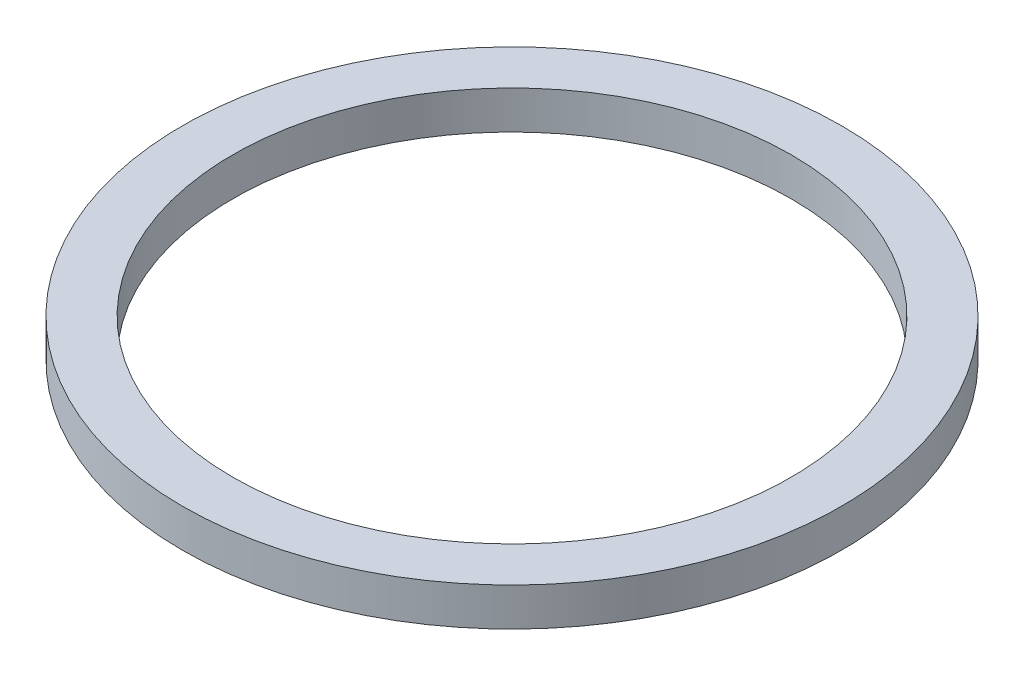
ISO-10303-21;
HEADER;
FILE_DESCRIPTION(('STEP AP214'),'2;1');
FILE_NAME('part.step','',(''),(''),'','','');
FILE_SCHEMA(('AUTOMOTIVE_DESIGN { 1 0 10303 214 1 1 1 1 }'));
ENDSEC;
DATA;
#1=APPLICATION_CONTEXT('core data for automotive mechanical design processes');
#2=APPLICATION_PROTOCOL_DEFINITION('international standard','automotive_design',2000,#1);
#3=PRODUCT_CONTEXT('',#1,'mechanical');
#4=PRODUCT('Part','Part','',(#3));
#5=PRODUCT_RELATED_PRODUCT_CATEGORY('part','',(#4));
#6=PRODUCT_DEFINITION_FORMATION('','',#4);
#7=PRODUCT_DEFINITION_CONTEXT('part definition',#1,'design');
#8=PRODUCT_DEFINITION('design','',#6,#7);
#9=PRODUCT_DEFINITION_SHAPE('','',#8);
#10=(LENGTH_UNIT() NAMED_UNIT(*) SI_UNIT(.MILLI.,.METRE.));
#11=(NAMED_UNIT(*) PLANE_ANGLE_UNIT() SI_UNIT($,.RADIAN.));
#12=(NAMED_UNIT(*) SI_UNIT($,.STERADIAN.) SOLID_ANGLE_UNIT());
#13=UNCERTAINTY_MEASURE_WITH_UNIT(LENGTH_MEASURE(1.E-05),#10,'distance_accuracy_value','');
#14=(GEOMETRIC_REPRESENTATION_CONTEXT(3) GLOBAL_UNCERTAINTY_ASSIGNED_CONTEXT((#13)) GLOBAL_UNIT_ASSIGNED_CONTEXT((#10,
#11,#12)) REPRESENTATION_CONTEXT('',''));
#15=CARTESIAN_POINT('',(0.,0.,0.));
#16=DIRECTION('',(0.,0.,1.));
#17=DIRECTION('',(1.,0.,0.));
#18=AXIS2_PLACEMENT_3D('',#15,#16,#17);
#19=CARTESIAN_POINT('',(0.,1.1,0.));
#20=DIRECTION('',(0.,-1.,0.));
#21=DIRECTION('',(0.,0.,-1.));
#22=AXIS2_PLACEMENT_3D('',#19,#20,#21);
#23=CYLINDRICAL_SURFACE('',#22,9.5);
#24=CARTESIAN_POINT('',(0.,1.1,0.));
#25=DIRECTION('',(0.,1.,0.));
#26=DIRECTION('',(0.,0.,1.));
#27=AXIS2_PLACEMENT_3D('',#24,#25,#26);
#28=CIRCLE('',#27,9.5);
#29=CARTESIAN_POINT('',(0.,1.1,9.5));
#30=VERTEX_POINT('',#29);
#31=EDGE_CURVE('E10',#30,#30,#28,.T.);
#32=ORIENTED_EDGE('',*,*,#31,.F.);
#33=EDGE_LOOP('',(#32));
#34=FACE_BOUND('',#33,.T.);
#35=CARTESIAN_POINT('',(0.,0.,0.));
#36=DIRECTION('',(0.,1.,0.));
#37=DIRECTION('',(0.,0.,1.));
#38=AXIS2_PLACEMENT_3D('',#35,#36,#37);
#39=CIRCLE('',#38,9.5);
#40=CARTESIAN_POINT('',(0.,0.,9.5));
#41=VERTEX_POINT('',#40);
#42=EDGE_CURVE('E35',#41,#41,#39,.T.);
#43=ORIENTED_EDGE('',*,*,#42,.T.);
#44=EDGE_LOOP('',(#43));
#45=FACE_BOUND('',#44,.T.);
#46=ADVANCED_FACE('F32',(#34,#45),#23,.T.);
#47=CARTESIAN_POINT('',(0.,1.1,0.));
#48=DIRECTION('',(0.,1.,0.));
#49=DIRECTION('',(0.,0.,1.));
#50=AXIS2_PLACEMENT_3D('',#47,#48,#49);
#51=PLANE('',#50);
#52=CARTESIAN_POINT('',(0.,1.1,0.));
#53=DIRECTION('',(0.,1.,0.));
#54=DIRECTION('',(0.,0.,1.));
#55=AXIS2_PLACEMENT_3D('',#52,#53,#54);
#56=CIRCLE('',#55,8.05);
#57=CARTESIAN_POINT('',(0.,1.1,8.05));
#58=VERTEX_POINT('',#57);
#59=EDGE_CURVE('E44',#58,#58,#56,.T.);
#60=ORIENTED_EDGE('',*,*,#59,.F.);
#61=EDGE_LOOP('',(#60));
#62=FACE_BOUND('',#61,.T.);
#63=ORIENTED_EDGE('',*,*,#31,.T.);
#64=EDGE_LOOP('',(#63));
#65=FACE_BOUND('',#64,.T.);
#66=ADVANCED_FACE('F59',(#62,#65),#51,.T.);
#67=CARTESIAN_POINT('',(0.,0.,0.));
#68=DIRECTION('',(0.,1.,0.));
#69=DIRECTION('',(0.,0.,1.));
#70=AXIS2_PLACEMENT_3D('',#67,#68,#69);
#71=PLANE('',#70);
#72=CARTESIAN_POINT('',(0.,0.,0.));
#73=DIRECTION('',(0.,1.,0.));
#74=DIRECTION('',(0.,0.,1.));
#75=AXIS2_PLACEMENT_3D('',#72,#73,#74);
#76=CIRCLE('',#75,8.05);
#77=CARTESIAN_POINT('',(0.,0.,8.05));
#78=VERTEX_POINT('',#77);
#79=EDGE_CURVE('E42',#78,#78,#76,.T.);
#80=ORIENTED_EDGE('',*,*,#79,.T.);
#81=EDGE_LOOP('',(#80));
#82=FACE_BOUND('',#81,.T.);
#83=ORIENTED_EDGE('',*,*,#42,.F.);
#84=EDGE_LOOP('',(#83));
#85=FACE_BOUND('',#84,.T.);
#86=ADVANCED_FACE('F50',(#82,#85),#71,.F.);
#87=CARTESIAN_POINT('',(0.,0.,0.));
#88=DIRECTION('',(0.,1.,0.));
#89=DIRECTION('',(0.,0.,1.));
#90=AXIS2_PLACEMENT_3D('',#87,#88,#89);
#91=CYLINDRICAL_SURFACE('',#90,8.05);
#92=ORIENTED_EDGE('',*,*,#79,.F.);
#93=EDGE_LOOP('',(#92));
#94=FACE_BOUND('',#93,.T.);
#95=ORIENTED_EDGE('',*,*,#59,.T.);
#96=EDGE_LOOP('',(#95));
#97=FACE_BOUND('',#96,.T.);
#98=ADVANCED_FACE('F53',(#94,#97),#91,.F.);
#99=CLOSED_SHELL('',(#46,#66,#86,#98));
#100=MANIFOLD_SOLID_BREP('B2',#99);
#101=ADVANCED_BREP_SHAPE_REPRESENTATION('',(#18,#100),#14);
#102=SHAPE_DEFINITION_REPRESENTATION(#9,#101);
ENDSEC;
END-ISO-10303-21;
